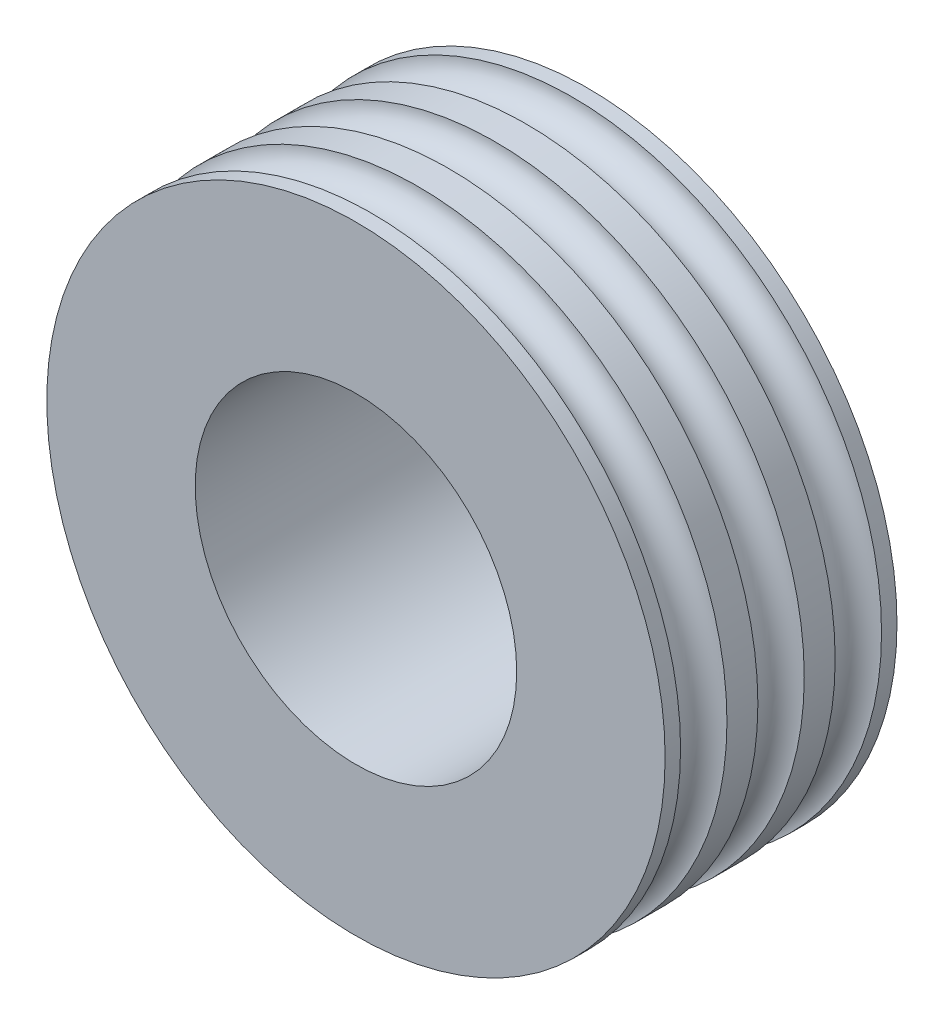
ISO-10303-21;
HEADER;
FILE_DESCRIPTION(('STEP AP214'),'2;1');
FILE_NAME('part.step','',(''),(''),'','','');
FILE_SCHEMA(('AUTOMOTIVE_DESIGN { 1 0 10303 214 1 1 1 1 }'));
ENDSEC;
DATA;
#1=APPLICATION_CONTEXT('core data for automotive mechanical design processes');
#2=APPLICATION_PROTOCOL_DEFINITION('international standard','automotive_design',2000,#1);
#3=PRODUCT_CONTEXT('',#1,'mechanical');
#4=PRODUCT('Part','Part','',(#3));
#5=PRODUCT_RELATED_PRODUCT_CATEGORY('part','',(#4));
#6=PRODUCT_DEFINITION_FORMATION('','',#4);
#7=PRODUCT_DEFINITION_CONTEXT('part definition',#1,'design');
#8=PRODUCT_DEFINITION('design','',#6,#7);
#9=PRODUCT_DEFINITION_SHAPE('','',#8);
#10=(LENGTH_UNIT() NAMED_UNIT(*) SI_UNIT(.MILLI.,.METRE.));
#11=(NAMED_UNIT(*) PLANE_ANGLE_UNIT() SI_UNIT($,.RADIAN.));
#12=(NAMED_UNIT(*) SI_UNIT($,.STERADIAN.) SOLID_ANGLE_UNIT());
#13=UNCERTAINTY_MEASURE_WITH_UNIT(LENGTH_MEASURE(1.E-05),#10,'distance_accuracy_value','');
#14=(GEOMETRIC_REPRESENTATION_CONTEXT(3) GLOBAL_UNCERTAINTY_ASSIGNED_CONTEXT((#13)) GLOBAL_UNIT_ASSIGNED_CONTEXT((#10,
#11,#12)) REPRESENTATION_CONTEXT('',''));
#15=CARTESIAN_POINT('',(0.,0.,0.));
#16=DIRECTION('',(0.,0.,1.));
#17=DIRECTION('',(1.,0.,0.));
#18=AXIS2_PLACEMENT_3D('',#15,#16,#17);
#19=CARTESIAN_POINT('',(0.,0.,3.0146773668033));
#20=DIRECTION('',(0.,0.,1.));
#21=DIRECTION('',(1.,0.,0.));
#22=AXIS2_PLACEMENT_3D('',#19,#20,#21);
#23=CYLINDRICAL_SURFACE('',#22,5.);
#24=CARTESIAN_POINT('',(0.,0.,0.));
#25=DIRECTION('',(0.,0.,1.));
#26=DIRECTION('',(1.,0.,0.));
#27=AXIS2_PLACEMENT_3D('',#24,#25,#26);
#28=CIRCLE('',#27,5.);
#29=CARTESIAN_POINT('',(5.,0.,0.));
#30=VERTEX_POINT('',#29);
#31=EDGE_CURVE('E10',#30,#30,#28,.T.);
#32=ORIENTED_EDGE('',*,*,#31,.F.);
#33=EDGE_LOOP('',(#32));
#34=FACE_BOUND('',#33,.T.);
#35=CARTESIAN_POINT('',(0.,0.,-0.5));
#36=DIRECTION('',(0.,0.,1.));
#37=DIRECTION('',(1.,0.,0.));
#38=AXIS2_PLACEMENT_3D('',#35,#36,#37);
#39=CIRCLE('',#38,5.);
#40=CARTESIAN_POINT('',(5.,0.,-0.5));
#41=VERTEX_POINT('',#40);
#42=EDGE_CURVE('E49',#41,#41,#39,.T.);
#43=ORIENTED_EDGE('',*,*,#42,.T.);
#44=EDGE_LOOP('',(#43));
#45=FACE_BOUND('',#44,.T.);
#46=ADVANCED_FACE('F37',(#34,#45),#23,.T.);
#47=CARTESIAN_POINT('',(0.,0.,0.375));
#48=DIRECTION('',(0.,0.,1.));
#49=DIRECTION('',(1.,0.,0.));
#50=AXIS2_PLACEMENT_3D('',#47,#48,#49);
#51=TOROIDAL_SURFACE('',#50,5.,0.375);
#52=CARTESIAN_POINT('',(0.,0.,0.75));
#53=DIRECTION('',(0.,0.,1.));
#54=DIRECTION('',(1.,0.,0.));
#55=AXIS2_PLACEMENT_3D('',#52,#53,#54);
#56=CIRCLE('',#55,5.);
#57=CARTESIAN_POINT('',(5.,0.,0.75));
#58=VERTEX_POINT('',#57);
#59=EDGE_CURVE('E44',#58,#58,#56,.T.);
#60=ORIENTED_EDGE('',*,*,#59,.F.);
#61=EDGE_LOOP('',(#60));
#62=FACE_BOUND('',#61,.T.);
#63=ORIENTED_EDGE('',*,*,#31,.T.);
#64=EDGE_LOOP('',(#63));
#65=FACE_BOUND('',#64,.T.);
#66=ADVANCED_FACE('F104',(#62,#65),#51,.F.);
#67=CARTESIAN_POINT('',(0.,0.,3.0146773668033));
#68=DIRECTION('',(0.,0.,1.));
#69=DIRECTION('',(1.,0.,0.));
#70=AXIS2_PLACEMENT_3D('',#67,#68,#69);
#71=CYLINDRICAL_SURFACE('',#70,5.);
#72=ORIENTED_EDGE('',*,*,#59,.T.);
#73=EDGE_LOOP('',(#72));
#74=FACE_BOUND('',#73,.T.);
#75=CARTESIAN_POINT('',(0.,0.,1.25));
#76=DIRECTION('',(0.,0.,1.));
#77=DIRECTION('',(1.,0.,0.));
#78=AXIS2_PLACEMENT_3D('',#75,#76,#77);
#79=CIRCLE('',#78,5.);
#80=CARTESIAN_POINT('',(5.,0.,1.25));
#81=VERTEX_POINT('',#80);
#82=EDGE_CURVE('E72',#81,#81,#79,.T.);
#83=ORIENTED_EDGE('',*,*,#82,.F.);
#84=EDGE_LOOP('',(#83));
#85=FACE_BOUND('',#84,.T.);
#86=ADVANCED_FACE('F109',(#74,#85),#71,.T.);
#87=CARTESIAN_POINT('',(0.,0.,3.0146773668033));
#88=DIRECTION('',(0.,0.,1.));
#89=DIRECTION('',(1.,0.,0.));
#90=AXIS2_PLACEMENT_3D('',#87,#88,#89);
#91=CYLINDRICAL_SURFACE('',#90,2.6);
#92=CARTESIAN_POINT('',(0.,0.,-1.5));
#93=DIRECTION('',(0.,0.,1.));
#94=DIRECTION('',(1.,0.,0.));
#95=AXIS2_PLACEMENT_3D('',#92,#93,#94);
#96=CIRCLE('',#95,2.6);
#97=CARTESIAN_POINT('',(2.6,0.,-1.5));
#98=VERTEX_POINT('',#97);
#99=EDGE_CURVE('E64',#98,#98,#96,.T.);
#100=ORIENTED_EDGE('',*,*,#99,.F.);
#101=EDGE_LOOP('',(#100));
#102=FACE_BOUND('',#101,.T.);
#103=CARTESIAN_POINT('',(0.,0.,2.25));
#104=DIRECTION('',(0.,0.,1.));
#105=DIRECTION('',(1.,0.,0.));
#106=AXIS2_PLACEMENT_3D('',#103,#104,#105);
#107=CIRCLE('',#106,2.6);
#108=CARTESIAN_POINT('',(2.6,0.,2.25));
#109=VERTEX_POINT('',#108);
#110=EDGE_CURVE('E76',#109,#109,#107,.T.);
#111=ORIENTED_EDGE('',*,*,#110,.T.);
#112=EDGE_LOOP('',(#111));
#113=FACE_BOUND('',#112,.T.);
#114=ADVANCED_FACE('F116',(#102,#113),#91,.F.);
#115=CARTESIAN_POINT('',(0.,0.,-0.875));
#116=DIRECTION('',(0.,0.,-1.));
#117=DIRECTION('',(1.,0.,0.));
#118=AXIS2_PLACEMENT_3D('',#115,#116,#117);
#119=TOROIDAL_SURFACE('',#118,5.,0.375);
#120=CARTESIAN_POINT('',(0.,0.,-1.25));
#121=DIRECTION('',(0.,0.,1.));
#122=DIRECTION('',(1.,0.,0.));
#123=AXIS2_PLACEMENT_3D('',#120,#121,#122);
#124=CIRCLE('',#123,5.);
#125=CARTESIAN_POINT('',(5.,0.,-1.25));
#126=VERTEX_POINT('',#125);
#127=EDGE_CURVE('E54',#126,#126,#124,.T.);
#128=ORIENTED_EDGE('',*,*,#127,.T.);
#129=EDGE_LOOP('',(#128));
#130=FACE_BOUND('',#129,.T.);
#131=ORIENTED_EDGE('',*,*,#42,.F.);
#132=EDGE_LOOP('',(#131));
#133=FACE_BOUND('',#132,.T.);
#134=ADVANCED_FACE('F114',(#130,#133),#119,.F.);
#135=CARTESIAN_POINT('',(0.,0.,-3.5146773668033));
#136=DIRECTION('',(0.,0.,-1.));
#137=DIRECTION('',(1.,0.,0.));
#138=AXIS2_PLACEMENT_3D('',#135,#136,#137);
#139=CYLINDRICAL_SURFACE('',#138,5.);
#140=CARTESIAN_POINT('',(0.,0.,-1.5));
#141=DIRECTION('',(0.,0.,1.));
#142=DIRECTION('',(1.,0.,0.));
#143=AXIS2_PLACEMENT_3D('',#140,#141,#142);
#144=CIRCLE('',#143,5.);
#145=CARTESIAN_POINT('',(5.,0.,-1.5));
#146=VERTEX_POINT('',#145);
#147=EDGE_CURVE('E60',#146,#146,#144,.T.);
#148=ORIENTED_EDGE('',*,*,#147,.T.);
#149=EDGE_LOOP('',(#148));
#150=FACE_BOUND('',#149,.T.);
#151=ORIENTED_EDGE('',*,*,#127,.F.);
#152=EDGE_LOOP('',(#151));
#153=FACE_BOUND('',#152,.T.);
#154=ADVANCED_FACE('F100',(#150,#153),#139,.T.);
#155=CARTESIAN_POINT('',(0.,5.,-1.5));
#156=DIRECTION('',(0.,0.,1.));
#157=DIRECTION('',(-1.,0.,0.));
#158=AXIS2_PLACEMENT_3D('',#155,#156,#157);
#159=PLANE('',#158);
#160=ORIENTED_EDGE('',*,*,#99,.T.);
#161=EDGE_LOOP('',(#160));
#162=FACE_BOUND('',#161,.T.);
#163=ORIENTED_EDGE('',*,*,#147,.F.);
#164=EDGE_LOOP('',(#163));
#165=FACE_BOUND('',#164,.T.);
#166=ADVANCED_FACE('F91',(#162,#165),#159,.F.);
#167=CARTESIAN_POINT('',(0.,0.,-1.0146773668033));
#168=DIRECTION('',(0.,0.,-1.));
#169=DIRECTION('',(1.,0.,0.));
#170=AXIS2_PLACEMENT_3D('',#167,#168,#169);
#171=CYLINDRICAL_SURFACE('',#170,5.);
#172=CARTESIAN_POINT('',(0.,0.,2.));
#173=DIRECTION('',(0.,0.,1.));
#174=DIRECTION('',(1.,0.,0.));
#175=AXIS2_PLACEMENT_3D('',#172,#173,#174);
#176=CIRCLE('',#175,5.);
#177=CARTESIAN_POINT('',(5.,0.,2.));
#178=VERTEX_POINT('',#177);
#179=EDGE_CURVE('E68',#178,#178,#176,.T.);
#180=ORIENTED_EDGE('',*,*,#179,.T.);
#181=EDGE_LOOP('',(#180));
#182=FACE_BOUND('',#181,.T.);
#183=CARTESIAN_POINT('',(0.,0.,2.25));
#184=DIRECTION('',(0.,0.,1.));
#185=DIRECTION('',(1.,0.,0.));
#186=AXIS2_PLACEMENT_3D('',#183,#184,#185);
#187=CIRCLE('',#186,5.);
#188=CARTESIAN_POINT('',(5.,0.,2.25));
#189=VERTEX_POINT('',#188);
#190=EDGE_CURVE('E80',#189,#189,#187,.T.);
#191=ORIENTED_EDGE('',*,*,#190,.F.);
#192=EDGE_LOOP('',(#191));
#193=FACE_BOUND('',#192,.T.);
#194=ADVANCED_FACE('F88',(#182,#193),#171,.T.);
#195=CARTESIAN_POINT('',(0.,0.,1.625));
#196=DIRECTION('',(0.,0.,-1.));
#197=DIRECTION('',(1.,0.,0.));
#198=AXIS2_PLACEMENT_3D('',#195,#196,#197);
#199=TOROIDAL_SURFACE('',#198,5.,0.375);
#200=ORIENTED_EDGE('',*,*,#82,.T.);
#201=EDGE_LOOP('',(#200));
#202=FACE_BOUND('',#201,.T.);
#203=ORIENTED_EDGE('',*,*,#179,.F.);
#204=EDGE_LOOP('',(#203));
#205=FACE_BOUND('',#204,.T.);
#206=ADVANCED_FACE('F90',(#202,#205),#199,.F.);
#207=CARTESIAN_POINT('',(0.,2.6,2.25));
#208=DIRECTION('',(0.,0.,-1.));
#209=DIRECTION('',(1.,0.,0.));
#210=AXIS2_PLACEMENT_3D('',#207,#208,#209);
#211=PLANE('',#210);
#212=ORIENTED_EDGE('',*,*,#190,.T.);
#213=EDGE_LOOP('',(#212));
#214=FACE_BOUND('',#213,.T.);
#215=ORIENTED_EDGE('',*,*,#110,.F.);
#216=EDGE_LOOP('',(#215));
#217=FACE_BOUND('',#216,.T.);
#218=ADVANCED_FACE('F85',(#214,#217),#211,.F.);
#219=CLOSED_SHELL('',(#46,#66,#86,#114,#134,#154,#166,#194,#206,#218));
#220=MANIFOLD_SOLID_BREP('B2',#219);
#221=ADVANCED_BREP_SHAPE_REPRESENTATION('',(#18,#220),#14);
#222=SHAPE_DEFINITION_REPRESENTATION(#9,#221);
ENDSEC;
END-ISO-10303-21;
